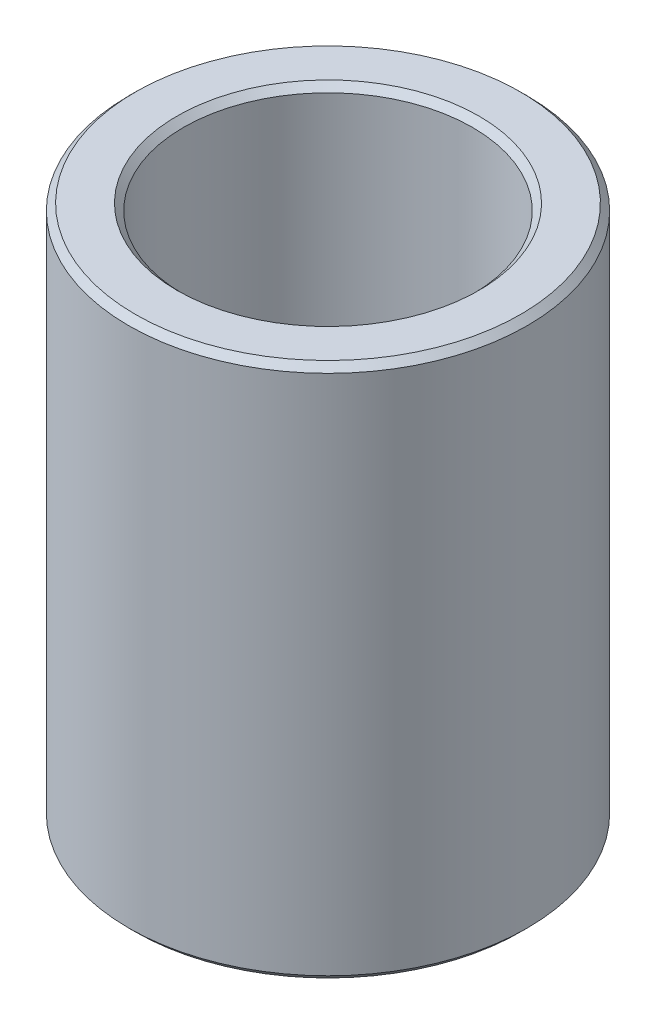
ISO-10303-21;
HEADER;
FILE_DESCRIPTION(('STEP AP214'),'2;1');
FILE_NAME('part.step','',(''),(''),'','','');
FILE_SCHEMA(('AUTOMOTIVE_DESIGN { 1 0 10303 214 1 1 1 1 }'));
ENDSEC;
DATA;
#1=APPLICATION_CONTEXT('core data for automotive mechanical design processes');
#2=APPLICATION_PROTOCOL_DEFINITION('international standard','automotive_design',2000,#1);
#3=PRODUCT_CONTEXT('',#1,'mechanical');
#4=PRODUCT('Part','Part','',(#3));
#5=PRODUCT_RELATED_PRODUCT_CATEGORY('part','',(#4));
#6=PRODUCT_DEFINITION_FORMATION('','',#4);
#7=PRODUCT_DEFINITION_CONTEXT('part definition',#1,'design');
#8=PRODUCT_DEFINITION('design','',#6,#7);
#9=PRODUCT_DEFINITION_SHAPE('','',#8);
#10=(LENGTH_UNIT() NAMED_UNIT(*) SI_UNIT(.MILLI.,.METRE.));
#11=(NAMED_UNIT(*) PLANE_ANGLE_UNIT() SI_UNIT($,.RADIAN.));
#12=(NAMED_UNIT(*) SI_UNIT($,.STERADIAN.) SOLID_ANGLE_UNIT());
#13=UNCERTAINTY_MEASURE_WITH_UNIT(LENGTH_MEASURE(1.E-05),#10,'distance_accuracy_value','');
#14=(GEOMETRIC_REPRESENTATION_CONTEXT(3) GLOBAL_UNCERTAINTY_ASSIGNED_CONTEXT((#13)) GLOBAL_UNIT_ASSIGNED_CONTEXT((#10,
#11,#12)) REPRESENTATION_CONTEXT('',''));
#15=CARTESIAN_POINT('',(0.,0.,0.));
#16=DIRECTION('',(0.,0.,1.));
#17=DIRECTION('',(1.,0.,0.));
#18=AXIS2_PLACEMENT_3D('',#15,#16,#17);
#19=CARTESIAN_POINT('',(0.,114.113695182037,0.));
#20=DIRECTION('',(0.,-1.,0.));
#21=DIRECTION('',(0.,0.,-1.));
#22=AXIS2_PLACEMENT_3D('',#19,#20,#21);
#23=CYLINDRICAL_SURFACE('',#22,42.5);
#24=CARTESIAN_POINT('',(0.,1.39255768489753,0.));
#25=DIRECTION('',(0.,1.,0.));
#26=DIRECTION('',(0.,0.,1.));
#27=AXIS2_PLACEMENT_3D('',#24,#25,#26);
#28=CIRCLE('',#27,42.5);
#29=CARTESIAN_POINT('',(0.,1.39255768489753,42.5));
#30=VERTEX_POINT('',#29);
#31=EDGE_CURVE('E10',#30,#30,#28,.T.);
#32=ORIENTED_EDGE('',*,*,#31,.T.);
#33=EDGE_LOOP('',(#32));
#34=FACE_BOUND('',#33,.T.);
#35=CARTESIAN_POINT('',(0.,112.72113749714,0.));
#36=DIRECTION('',(0.,1.,0.));
#37=DIRECTION('',(0.,0.,1.));
#38=AXIS2_PLACEMENT_3D('',#35,#36,#37);
#39=CIRCLE('',#38,42.5);
#40=CARTESIAN_POINT('',(0.,112.72113749714,42.5));
#41=VERTEX_POINT('',#40);
#42=EDGE_CURVE('E50',#41,#41,#39,.F.);
#43=ORIENTED_EDGE('',*,*,#42,.T.);
#44=EDGE_LOOP('',(#43));
#45=FACE_BOUND('',#44,.T.);
#46=ADVANCED_FACE('F39',(#34,#45),#23,.T.);
#47=CARTESIAN_POINT('',(0.,114.113695182037,0.));
#48=DIRECTION('',(0.,1.,0.));
#49=DIRECTION('',(0.,0.,1.));
#50=AXIS2_PLACEMENT_3D('',#47,#48,#49);
#51=PLANE('',#50);
#52=CARTESIAN_POINT('',(0.,114.113695182037,0.));
#53=DIRECTION('',(0.,1.,0.));
#54=DIRECTION('',(0.,0.,1.));
#55=AXIS2_PLACEMENT_3D('',#52,#53,#54);
#56=CIRCLE('',#55,32.2239131308318);
#57=CARTESIAN_POINT('',(0.,114.113695182037,32.2239131308318));
#58=VERTEX_POINT('',#57);
#59=EDGE_CURVE('E58',#58,#58,#56,.F.);
#60=ORIENTED_EDGE('',*,*,#59,.T.);
#61=EDGE_LOOP('',(#60));
#62=FACE_BOUND('',#61,.T.);
#63=CARTESIAN_POINT('',(0.,114.113695182037,0.));
#64=DIRECTION('',(0.,1.,0.));
#65=DIRECTION('',(0.,0.,1.));
#66=AXIS2_PLACEMENT_3D('',#63,#64,#65);
#67=CIRCLE('',#66,41.1074423151024);
#68=CARTESIAN_POINT('',(0.,114.113695182037,41.1074423151024));
#69=VERTEX_POINT('',#68);
#70=EDGE_CURVE('E61',#69,#69,#67,.T.);
#71=ORIENTED_EDGE('',*,*,#70,.T.);
#72=EDGE_LOOP('',(#71));
#73=FACE_BOUND('',#72,.T.);
#74=ADVANCED_FACE('F88',(#62,#73),#51,.T.);
#75=CARTESIAN_POINT('',(0.,0.,0.));
#76=DIRECTION('',(0.,1.,0.));
#77=DIRECTION('',(0.,0.,1.));
#78=AXIS2_PLACEMENT_3D('',#75,#76,#77);
#79=PLANE('',#78);
#80=CARTESIAN_POINT('',(0.,0.,0.));
#81=DIRECTION('',(0.,1.,0.));
#82=DIRECTION('',(0.,0.,1.));
#83=AXIS2_PLACEMENT_3D('',#80,#81,#82);
#84=CIRCLE('',#83,32.2239131308319);
#85=CARTESIAN_POINT('',(0.,0.,32.2239131308319));
#86=VERTEX_POINT('',#85);
#87=EDGE_CURVE('E51',#86,#86,#84,.T.);
#88=ORIENTED_EDGE('',*,*,#87,.T.);
#89=EDGE_LOOP('',(#88));
#90=FACE_BOUND('',#89,.T.);
#91=CARTESIAN_POINT('',(0.,0.,0.));
#92=DIRECTION('',(0.,1.,0.));
#93=DIRECTION('',(0.,0.,1.));
#94=AXIS2_PLACEMENT_3D('',#91,#92,#93);
#95=CIRCLE('',#94,41.1074423151025);
#96=CARTESIAN_POINT('',(0.,0.,41.1074423151025));
#97=VERTEX_POINT('',#96);
#98=EDGE_CURVE('E54',#97,#97,#95,.F.);
#99=ORIENTED_EDGE('',*,*,#98,.T.);
#100=EDGE_LOOP('',(#99));
#101=FACE_BOUND('',#100,.T.);
#102=ADVANCED_FACE('F83',(#90,#101),#79,.F.);
#103=CARTESIAN_POINT('',(0.,114.113695182037,0.));
#104=DIRECTION('',(0.,-1.,0.));
#105=DIRECTION('',(0.,0.,-1.));
#106=AXIS2_PLACEMENT_3D('',#103,#104,#105);
#107=CYLINDRICAL_SURFACE('',#106,30.8313554459343);
#108=CARTESIAN_POINT('',(0.,112.72113749714,0.));
#109=DIRECTION('',(0.,1.,0.));
#110=DIRECTION('',(0.,0.,1.));
#111=AXIS2_PLACEMENT_3D('',#108,#109,#110);
#112=CIRCLE('',#111,30.8313554459343);
#113=CARTESIAN_POINT('',(0.,112.72113749714,30.8313554459343));
#114=VERTEX_POINT('',#113);
#115=EDGE_CURVE('E67',#114,#114,#112,.T.);
#116=ORIENTED_EDGE('',*,*,#115,.T.);
#117=EDGE_LOOP('',(#116));
#118=FACE_BOUND('',#117,.T.);
#119=CARTESIAN_POINT('',(0.,1.39255768489756,0.));
#120=DIRECTION('',(0.,1.,0.));
#121=DIRECTION('',(0.,0.,1.));
#122=AXIS2_PLACEMENT_3D('',#119,#120,#121);
#123=CIRCLE('',#122,30.8313554459343);
#124=CARTESIAN_POINT('',(0.,1.39255768489756,30.8313554459343));
#125=VERTEX_POINT('',#124);
#126=EDGE_CURVE('E69',#125,#125,#123,.F.);
#127=ORIENTED_EDGE('',*,*,#126,.T.);
#128=EDGE_LOOP('',(#127));
#129=FACE_BOUND('',#128,.T.);
#130=ADVANCED_FACE('F71',(#118,#129),#107,.F.);
#131=CARTESIAN_POINT('',(0.,112.72113749714,0.));
#132=DIRECTION('',(0.,1.,0.));
#133=DIRECTION('',(0.,0.,1.));
#134=AXIS2_PLACEMENT_3D('',#131,#132,#133);
#135=CONICAL_SURFACE('',#134,30.8313554459343,0.785398163397446);
#136=ORIENTED_EDGE('',*,*,#59,.F.);
#137=EDGE_LOOP('',(#136));
#138=FACE_BOUND('',#137,.T.);
#139=ORIENTED_EDGE('',*,*,#115,.F.);
#140=EDGE_LOOP('',(#139));
#141=FACE_BOUND('',#140,.T.);
#142=ADVANCED_FACE('F77',(#138,#141),#135,.F.);
#143=CARTESIAN_POINT('',(0.,0.,0.));
#144=DIRECTION('',(0.,-1.,0.));
#145=DIRECTION('',(0.,0.,-1.));
#146=AXIS2_PLACEMENT_3D('',#143,#144,#145);
#147=CONICAL_SURFACE('',#146,32.2239131308319,0.785398163397446);
#148=ORIENTED_EDGE('',*,*,#126,.F.);
#149=EDGE_LOOP('',(#148));
#150=FACE_BOUND('',#149,.T.);
#151=ORIENTED_EDGE('',*,*,#87,.F.);
#152=EDGE_LOOP('',(#151));
#153=FACE_BOUND('',#152,.T.);
#154=ADVANCED_FACE('F73',(#150,#153),#147,.F.);
#155=CARTESIAN_POINT('',(0.,1.39255768489753,0.));
#156=DIRECTION('',(0.,1.,0.));
#157=DIRECTION('',(0.,0.,1.));
#158=AXIS2_PLACEMENT_3D('',#155,#156,#157);
#159=CONICAL_SURFACE('',#158,42.5,0.785398163397453);
#160=ORIENTED_EDGE('',*,*,#98,.F.);
#161=EDGE_LOOP('',(#160));
#162=FACE_BOUND('',#161,.T.);
#163=ORIENTED_EDGE('',*,*,#31,.F.);
#164=EDGE_LOOP('',(#163));
#165=FACE_BOUND('',#164,.T.);
#166=ADVANCED_FACE('F76',(#162,#165),#159,.T.);
#167=CARTESIAN_POINT('',(0.,114.113695182037,0.));
#168=DIRECTION('',(0.,-1.,0.));
#169=DIRECTION('',(0.,0.,-1.));
#170=AXIS2_PLACEMENT_3D('',#167,#168,#169);
#171=CONICAL_SURFACE('',#170,41.1074423151024,0.785398163397443);
#172=ORIENTED_EDGE('',*,*,#42,.F.);
#173=EDGE_LOOP('',(#172));
#174=FACE_BOUND('',#173,.T.);
#175=ORIENTED_EDGE('',*,*,#70,.F.);
#176=EDGE_LOOP('',(#175));
#177=FACE_BOUND('',#176,.T.);
#178=ADVANCED_FACE('F45',(#174,#177),#171,.T.);
#179=CLOSED_SHELL('',(#46,#74,#102,#130,#142,#154,#166,#178));
#180=MANIFOLD_SOLID_BREP('B2',#179);
#181=ADVANCED_BREP_SHAPE_REPRESENTATION('',(#18,#180),#14);
#182=SHAPE_DEFINITION_REPRESENTATION(#9,#181);
ENDSEC;
END-ISO-10303-21;
